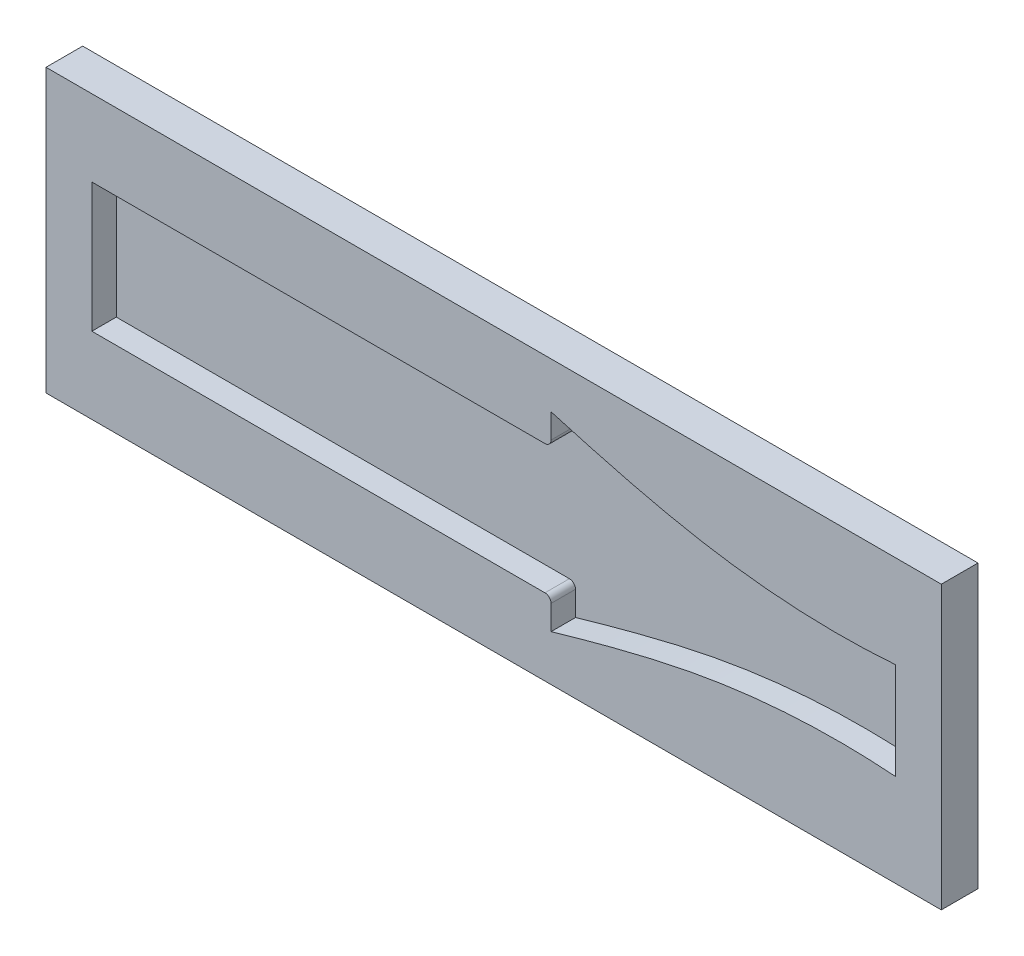
ISO-10303-21;
HEADER;
FILE_DESCRIPTION(('STEP AP214'),'2;1');
FILE_NAME('part.step','',(''),(''),'','','');
FILE_SCHEMA(('AUTOMOTIVE_DESIGN { 1 0 10303 214 1 1 1 1 }'));
ENDSEC;
DATA;
#1=APPLICATION_CONTEXT('core data for automotive mechanical design processes');
#2=APPLICATION_PROTOCOL_DEFINITION('international standard','automotive_design',2000,#1);
#3=PRODUCT_CONTEXT('',#1,'mechanical');
#4=PRODUCT('Part','Part','',(#3));
#5=PRODUCT_RELATED_PRODUCT_CATEGORY('part','',(#4));
#6=PRODUCT_DEFINITION_FORMATION('','',#4);
#7=PRODUCT_DEFINITION_CONTEXT('part definition',#1,'design');
#8=PRODUCT_DEFINITION('design','',#6,#7);
#9=PRODUCT_DEFINITION_SHAPE('','',#8);
#10=(LENGTH_UNIT() NAMED_UNIT(*) SI_UNIT(.MILLI.,.METRE.));
#11=(NAMED_UNIT(*) PLANE_ANGLE_UNIT() SI_UNIT($,.RADIAN.));
#12=(NAMED_UNIT(*) SI_UNIT($,.STERADIAN.) SOLID_ANGLE_UNIT());
#13=UNCERTAINTY_MEASURE_WITH_UNIT(LENGTH_MEASURE(1.E-05),#10,'distance_accuracy_value','');
#14=(GEOMETRIC_REPRESENTATION_CONTEXT(3) GLOBAL_UNCERTAINTY_ASSIGNED_CONTEXT((#13)) GLOBAL_UNIT_ASSIGNED_CONTEXT((#10,
#11,#12)) REPRESENTATION_CONTEXT('',''));
#15=CARTESIAN_POINT('',(0.,0.,0.));
#16=DIRECTION('',(0.,0.,1.));
#17=DIRECTION('',(1.,0.,0.));
#18=AXIS2_PLACEMENT_3D('',#15,#16,#17);
#19=CARTESIAN_POINT('',(155.9,15.5713450063718,10.));
#20=DIRECTION('',(1.,0.,0.));
#21=DIRECTION('',(0.,0.,-1.));
#22=AXIS2_PLACEMENT_3D('',#19,#20,#21);
#23=PLANE('',#22);
#24=DIRECTION('',(0.,-1.,0.));
#25=VECTOR('',#24,1.);
#26=CARTESIAN_POINT('',(155.9,15.5713450063718,10.));
#27=LINE('',#26,#25);
#28=CARTESIAN_POINT('',(155.9,10.5713450063718,10.));
#29=VERTEX_POINT('',#28);
#30=CARTESIAN_POINT('',(155.9,-10.5713450063718,10.));
#31=VERTEX_POINT('',#30);
#32=EDGE_CURVE('E301',#29,#31,#27,.T.);
#33=ORIENTED_EDGE('',*,*,#32,.T.);
#34=DIRECTION('',(0.,0.,-1.));
#35=VECTOR('',#34,1.);
#36=CARTESIAN_POINT('',(155.9,-10.5713450063718,10.));
#37=LINE('',#36,#35);
#38=CARTESIAN_POINT('',(155.9,-10.5713450063718,6.));
#39=VERTEX_POINT('',#38);
#40=EDGE_CURVE('E243',#31,#39,#37,.T.);
#41=ORIENTED_EDGE('',*,*,#40,.T.);
#42=DIRECTION('',(0.,-1.,0.));
#43=VECTOR('',#42,1.);
#44=CARTESIAN_POINT('',(155.9,15.5713450063718,6.));
#45=LINE('',#44,#43);
#46=CARTESIAN_POINT('',(155.9,10.5713450063718,6.));
#47=VERTEX_POINT('',#46);
#48=EDGE_CURVE('E281',#47,#39,#45,.T.);
#49=ORIENTED_EDGE('',*,*,#48,.F.);
#50=DIRECTION('',(0.,0.,-1.));
#51=VECTOR('',#50,1.);
#52=CARTESIAN_POINT('',(155.9,10.5713450063718,10.));
#53=LINE('',#52,#51);
#54=EDGE_CURVE('E272',#29,#47,#53,.T.);
#55=ORIENTED_EDGE('',*,*,#54,.F.);
#56=EDGE_LOOP('',(#33,#41,#49,#55));
#57=FACE_BOUND('',#56,.T.);
#58=ADVANCED_FACE('F40',(#57),#23,.T.);
#59=CARTESIAN_POINT('',(0.,0.,6.));
#60=DIRECTION('',(0.,0.,1.));
#61=DIRECTION('',(1.,0.,0.));
#62=AXIS2_PLACEMENT_3D('',#59,#60,#61);
#63=PLANE('',#62);
#64=CARTESIAN_POINT('',(230.014073024287,-11.5713450063718,6.));
#65=DIRECTION('',(0.,0.,1.));
#66=DIRECTION('',(1.,0.,0.));
#67=AXIS2_PLACEMENT_3D('',#64,#65,#66);
#68=CIRCLE('',#67,1.);
#69=CARTESIAN_POINT('',(231.014073024287,-11.5713450063718,6.));
#70=VERTEX_POINT('',#69);
#71=CARTESIAN_POINT('',(230.014073024287,-10.5713450063718,6.));
#72=VERTEX_POINT('',#71);
#73=EDGE_CURVE('E233',#70,#72,#68,.T.);
#74=ORIENTED_EDGE('',*,*,#73,.F.);
#75=DIRECTION('',(0.,1.,0.));
#76=VECTOR('',#75,1.);
#77=CARTESIAN_POINT('',(231.014073024287,-15.5713450063718,6.));
#78=LINE('',#77,#76);
#79=CARTESIAN_POINT('',(231.014073024287,-15.5713450063718,6.));
#80=VERTEX_POINT('',#79);
#81=EDGE_CURVE('E239',#80,#70,#78,.T.);
#82=ORIENTED_EDGE('',*,*,#81,.F.);
#83=CARTESIAN_POINT('',(231.014073024287,-15.5713450063718,6.));
#84=CARTESIAN_POINT('',(235.603926113543,-14.2533804538712,6.));
#85=CARTESIAN_POINT('',(240.202907460829,-12.9692204062925,6.));
#86=CARTESIAN_POINT('',(247.161881800871,-11.2670374263677,6.));
#87=CARTESIAN_POINT('',(249.48937433245,-10.7379913566048,6.));
#88=CARTESIAN_POINT('',(254.16564176773,-9.78721352573088,6.));
#89=CARTESIAN_POINT('',(256.514768347563,-9.36682252587505,6.));
#90=CARTESIAN_POINT('',(263.601279745271,-8.30142744081336,6.));
#91=CARTESIAN_POINT('',(268.33808653074,-7.84882620076479,6.));
#92=CARTESIAN_POINT('',(275.456073059196,-7.56828948111183,6.));
#93=CARTESIAN_POINT('',(277.831222275919,-7.54136255551402,6.));
#94=CARTESIAN_POINT('',(282.586677641529,-7.62557478684483,6.));
#95=CARTESIAN_POINT('',(284.967063297442,-7.73884257829425,6.));
#96=CARTESIAN_POINT('',(287.35,-7.9204093128877,6.));
#97=B_SPLINE_CURVE_WITH_KNOTS('',3,(#83,#84,#85,#86,#87,#88,#89,#90,#91,#92,#93,#94,#95,#96),
.UNSPECIFIED.,.F.,.F.,(4,2,2,2,2,2,4),(0.,0.25,0.375000000000001,0.500000000000002,
0.750000000000001,0.875000000000001,1.),.UNSPECIFIED.);
#98=CARTESIAN_POINT('',(287.35,-7.9204093128877,6.));
#99=VERTEX_POINT('',#98);
#100=EDGE_CURVE('E275',#80,#99,#97,.T.);
#101=ORIENTED_EDGE('',*,*,#100,.T.);
#102=DIRECTION('',(0.,1.,0.));
#103=VECTOR('',#102,1.);
#104=CARTESIAN_POINT('',(287.35,-7.9204093128877,6.));
#105=LINE('',#104,#103);
#106=CARTESIAN_POINT('',(287.35,7.92040931288748,6.));
#107=VERTEX_POINT('',#106);
#108=EDGE_CURVE('E49',#99,#107,#105,.T.);
#109=ORIENTED_EDGE('',*,*,#108,.T.);
#110=CARTESIAN_POINT('',(287.35,7.92040931288747,6.));
#111=CARTESIAN_POINT('',(284.969156465428,7.73900206624337,6.));
#112=CARTESIAN_POINT('',(282.587135428671,7.62548449338519,6.));
#113=CARTESIAN_POINT('',(277.8206161659,7.54127334658861,6.));
#114=CARTESIAN_POINT('',(275.436154733433,7.56845841607429,6.));
#115=CARTESIAN_POINT('',(268.279260354869,7.85238969523881,6.));
#116=CARTESIAN_POINT('',(263.532649453203,8.30935777848794,6.));
#117=CARTESIAN_POINT('',(256.450993940036,9.37762924089552,6.));
#118=CARTESIAN_POINT('',(254.104302815862,9.79880165950476,6.));
#119=CARTESIAN_POINT('',(249.438001236652,10.7493414193286,6.));
#120=CARTESIAN_POINT('',(247.117364999516,11.2775083415618,6.));
#121=CARTESIAN_POINT('',(240.182218105515,12.9751270956092,6.));
#122=CARTESIAN_POINT('',(235.594114601691,14.2561978043551,6.));
#123=CARTESIAN_POINT('',(231.014073024287,15.5713450063718,6.));
#124=B_SPLINE_CURVE_WITH_KNOTS('',3,(#110,#111,#112,#113,#114,#115,#116,#117,#118,#119,#120,
#121,#122,#123),.UNSPECIFIED.,.F.,.F.,(4,2,2,2,2,2,4),(0.,0.124999999999999,0.249999999999998,
0.499999999999995,0.624999999999995,0.749999999999997,1.),.UNSPECIFIED.);
#125=CARTESIAN_POINT('',(231.014073024287,15.5713450063718,6.));
#126=VERTEX_POINT('',#125);
#127=EDGE_CURVE('E288',#107,#126,#124,.T.);
#128=ORIENTED_EDGE('',*,*,#127,.T.);
#129=DIRECTION('',(0.,1.,0.));
#130=VECTOR('',#129,1.);
#131=CARTESIAN_POINT('',(231.014073024287,15.5713450063718,6.));
#132=LINE('',#131,#130);
#133=CARTESIAN_POINT('',(231.014073024287,11.5713450063718,6.));
#134=VERTEX_POINT('',#133);
#135=EDGE_CURVE('E251',#134,#126,#132,.T.);
#136=ORIENTED_EDGE('',*,*,#135,.F.);
#137=CARTESIAN_POINT('',(230.014073024287,11.5713450063718,6.));
#138=DIRECTION('',(0.,0.,1.));
#139=DIRECTION('',(-1.,0.,0.));
#140=AXIS2_PLACEMENT_3D('',#137,#138,#139);
#141=CIRCLE('',#140,1.);
#142=CARTESIAN_POINT('',(230.014073024287,10.5713450063718,6.));
#143=VERTEX_POINT('',#142);
#144=EDGE_CURVE('E220',#143,#134,#141,.T.);
#145=ORIENTED_EDGE('',*,*,#144,.F.);
#146=DIRECTION('',(1.,0.,0.));
#147=VECTOR('',#146,1.);
#148=CARTESIAN_POINT('',(230.014073024287,10.5713450063718,6.));
#149=LINE('',#148,#147);
#150=EDGE_CURVE('E260',#47,#143,#149,.T.);
#151=ORIENTED_EDGE('',*,*,#150,.F.);
#152=ORIENTED_EDGE('',*,*,#48,.T.);
#153=DIRECTION('',(-1.,0.,0.));
#154=VECTOR('',#153,1.);
#155=CARTESIAN_POINT('',(230.014073024287,-10.5713450063718,6.));
#156=LINE('',#155,#154);
#157=EDGE_CURVE('E226',#72,#39,#156,.T.);
#158=ORIENTED_EDGE('',*,*,#157,.F.);
#159=EDGE_LOOP('',(#74,#82,#101,#109,#128,#136,#145,#151,#152,#158));
#160=FACE_BOUND('',#159,.T.);
#161=ADVANCED_FACE('F197',(#160),#63,.T.);
#162=CARTESIAN_POINT('',(0.,0.,10.));
#163=DIRECTION('',(0.,0.,1.));
#164=DIRECTION('',(1.,0.,0.));
#165=AXIS2_PLACEMENT_3D('',#162,#163,#164);
#166=PLANE('',#165);
#167=DIRECTION('',(0.,-1.,0.));
#168=VECTOR('',#167,1.);
#169=CARTESIAN_POINT('',(148.4,23.0713450063718,10.));
#170=LINE('',#169,#168);
#171=CARTESIAN_POINT('',(148.4,23.0713450063718,10.));
#172=VERTEX_POINT('',#171);
#173=CARTESIAN_POINT('',(148.4,-23.0713450063718,10.));
#174=VERTEX_POINT('',#173);
#175=EDGE_CURVE('E369',#172,#174,#170,.T.);
#176=ORIENTED_EDGE('',*,*,#175,.T.);
#177=DIRECTION('',(1.,0.,0.));
#178=VECTOR('',#177,1.);
#179=CARTESIAN_POINT('',(148.4,-23.0713450063718,10.));
#180=LINE('',#179,#178);
#181=CARTESIAN_POINT('',(294.85,-23.0713450063718,10.));
#182=VERTEX_POINT('',#181);
#183=EDGE_CURVE('E375',#174,#182,#180,.T.);
#184=ORIENTED_EDGE('',*,*,#183,.T.);
#185=DIRECTION('',(0.,1.,0.));
#186=VECTOR('',#185,1.);
#187=CARTESIAN_POINT('',(294.85,23.0713450063718,10.));
#188=LINE('',#187,#186);
#189=CARTESIAN_POINT('',(294.85,23.0713450063718,10.));
#190=VERTEX_POINT('',#189);
#191=EDGE_CURVE('E378',#182,#190,#188,.T.);
#192=ORIENTED_EDGE('',*,*,#191,.T.);
#193=DIRECTION('',(-1.,0.,0.));
#194=VECTOR('',#193,1.);
#195=CARTESIAN_POINT('',(148.4,23.0713450063718,10.));
#196=LINE('',#195,#194);
#197=EDGE_CURVE('E160',#190,#172,#196,.T.);
#198=ORIENTED_EDGE('',*,*,#197,.T.);
#199=EDGE_LOOP('',(#176,#184,#192,#198));
#200=FACE_BOUND('',#199,.T.);
#201=DIRECTION('',(0.,1.,0.));
#202=VECTOR('',#201,1.);
#203=CARTESIAN_POINT('',(231.014073024287,15.5713450063718,10.));
#204=LINE('',#203,#202);
#205=CARTESIAN_POINT('',(231.014073024287,11.5713450063718,10.));
#206=VERTEX_POINT('',#205);
#207=CARTESIAN_POINT('',(231.014073024287,15.5713450063718,10.));
#208=VERTEX_POINT('',#207);
#209=EDGE_CURVE('E216',#206,#208,#204,.T.);
#210=ORIENTED_EDGE('',*,*,#209,.T.);
#211=CARTESIAN_POINT('',(287.35,7.92040931288747,10.));
#212=CARTESIAN_POINT('',(284.969156465428,7.73900206624337,10.));
#213=CARTESIAN_POINT('',(282.587135428671,7.62548449338519,10.));
#214=CARTESIAN_POINT('',(277.8206161659,7.54127334658861,10.));
#215=CARTESIAN_POINT('',(275.436154733433,7.56845841607429,10.));
#216=CARTESIAN_POINT('',(268.279260354869,7.85238969523881,10.));
#217=CARTESIAN_POINT('',(263.532649453203,8.30935777848794,10.));
#218=CARTESIAN_POINT('',(256.450993940036,9.37762924089552,10.));
#219=CARTESIAN_POINT('',(254.104302815862,9.79880165950476,10.));
#220=CARTESIAN_POINT('',(249.438001236652,10.7493414193286,10.));
#221=CARTESIAN_POINT('',(247.117364999516,11.2775083415618,10.));
#222=CARTESIAN_POINT('',(240.182218105515,12.9751270956092,10.));
#223=CARTESIAN_POINT('',(235.594114601691,14.2561978043551,10.));
#224=CARTESIAN_POINT('',(231.014073024287,15.5713450063718,10.));
#225=B_SPLINE_CURVE_WITH_KNOTS('',3,(#211,#212,#213,#214,#215,#216,#217,#218,#219,#220,#221,
#222,#223,#224),.UNSPECIFIED.,.F.,.F.,(4,2,2,2,2,2,4),(0.,0.124999999999999,0.249999999999998,
0.499999999999995,0.624999999999995,0.749999999999997,1.),.UNSPECIFIED.);
#226=CARTESIAN_POINT('',(287.35,7.92040931288747,10.));
#227=VERTEX_POINT('',#226);
#228=EDGE_CURVE('E293',#227,#208,#225,.T.);
#229=ORIENTED_EDGE('',*,*,#228,.F.);
#230=DIRECTION('',(0.,1.,0.));
#231=VECTOR('',#230,1.);
#232=CARTESIAN_POINT('',(287.35,-7.9204093128877,10.));
#233=LINE('',#232,#231);
#234=CARTESIAN_POINT('',(287.35,-7.9204093128877,10.));
#235=VERTEX_POINT('',#234);
#236=EDGE_CURVE('E345',#235,#227,#233,.T.);
#237=ORIENTED_EDGE('',*,*,#236,.F.);
#238=CARTESIAN_POINT('',(231.014073024287,-15.5713450063718,10.));
#239=CARTESIAN_POINT('',(235.603926113543,-14.2533804538712,10.));
#240=CARTESIAN_POINT('',(240.202907460829,-12.9692204062925,10.));
#241=CARTESIAN_POINT('',(247.161881800871,-11.2670374263677,10.));
#242=CARTESIAN_POINT('',(249.48937433245,-10.7379913566048,10.));
#243=CARTESIAN_POINT('',(254.16564176773,-9.78721352573088,10.));
#244=CARTESIAN_POINT('',(256.514768347563,-9.36682252587505,10.));
#245=CARTESIAN_POINT('',(263.601279745271,-8.30142744081336,10.));
#246=CARTESIAN_POINT('',(268.33808653074,-7.84882620076479,10.));
#247=CARTESIAN_POINT('',(275.456073059196,-7.56828948111183,10.));
#248=CARTESIAN_POINT('',(277.831222275919,-7.54136255551402,10.));
#249=CARTESIAN_POINT('',(282.586677641529,-7.62557478684483,10.));
#250=CARTESIAN_POINT('',(284.967063297442,-7.73884257829425,10.));
#251=CARTESIAN_POINT('',(287.35,-7.9204093128877,10.));
#252=B_SPLINE_CURVE_WITH_KNOTS('',3,(#238,#239,#240,#241,#242,#243,#244,#245,#246,#247,#248,
#249,#250,#251),.UNSPECIFIED.,.F.,.F.,(4,2,2,2,2,2,4),(0.,0.25,0.375000000000001,
0.500000000000002,0.750000000000001,0.875000000000001,1.),.UNSPECIFIED.);
#253=CARTESIAN_POINT('',(231.014073024287,-15.5713450063718,10.));
#254=VERTEX_POINT('',#253);
#255=EDGE_CURVE('E180',#254,#235,#252,.T.);
#256=ORIENTED_EDGE('',*,*,#255,.F.);
#257=DIRECTION('',(0.,1.,0.));
#258=VECTOR('',#257,1.);
#259=CARTESIAN_POINT('',(231.014073024287,-15.5713450063718,10.));
#260=LINE('',#259,#258);
#261=CARTESIAN_POINT('',(231.014073024287,-11.5713450063718,10.));
#262=VERTEX_POINT('',#261);
#263=EDGE_CURVE('E223',#254,#262,#260,.T.);
#264=ORIENTED_EDGE('',*,*,#263,.T.);
#265=CARTESIAN_POINT('',(230.014073024287,-11.5713450063718,10.));
#266=DIRECTION('',(0.,0.,1.));
#267=DIRECTION('',(1.,0.,0.));
#268=AXIS2_PLACEMENT_3D('',#265,#266,#267);
#269=CIRCLE('',#268,1.);
#270=CARTESIAN_POINT('',(230.014073024287,-10.5713450063718,10.));
#271=VERTEX_POINT('',#270);
#272=EDGE_CURVE('E225',#262,#271,#269,.T.);
#273=ORIENTED_EDGE('',*,*,#272,.T.);
#274=DIRECTION('',(-1.,0.,0.));
#275=VECTOR('',#274,1.);
#276=CARTESIAN_POINT('',(230.014073024287,-10.5713450063718,10.));
#277=LINE('',#276,#275);
#278=EDGE_CURVE('E231',#271,#31,#277,.T.);
#279=ORIENTED_EDGE('',*,*,#278,.T.);
#280=ORIENTED_EDGE('',*,*,#32,.F.);
#281=DIRECTION('',(1.,0.,0.));
#282=VECTOR('',#281,1.);
#283=CARTESIAN_POINT('',(230.014073024287,10.5713450063718,10.));
#284=LINE('',#283,#282);
#285=CARTESIAN_POINT('',(230.014073024287,10.5713450063718,10.));
#286=VERTEX_POINT('',#285);
#287=EDGE_CURVE('E219',#29,#286,#284,.T.);
#288=ORIENTED_EDGE('',*,*,#287,.T.);
#289=CARTESIAN_POINT('',(230.014073024287,11.5713450063718,10.));
#290=DIRECTION('',(0.,0.,1.));
#291=DIRECTION('',(-1.,0.,0.));
#292=AXIS2_PLACEMENT_3D('',#289,#290,#291);
#293=CIRCLE('',#292,1.);
#294=EDGE_CURVE('E254',#286,#206,#293,.T.);
#295=ORIENTED_EDGE('',*,*,#294,.T.);
#296=EDGE_LOOP('',(#210,#229,#237,#256,#264,#273,#279,#280,#288,#295));
#297=FACE_BOUND('',#296,.T.);
#298=ADVANCED_FACE('F187',(#200,#297),#166,.T.);
#299=CARTESIAN_POINT('',(148.4,23.0713450063718,10.));
#300=DIRECTION('',(1.,0.,0.));
#301=DIRECTION('',(0.,0.,-1.));
#302=AXIS2_PLACEMENT_3D('',#299,#300,#301);
#303=PLANE('',#302);
#304=DIRECTION('',(0.,0.,-1.));
#305=VECTOR('',#304,1.);
#306=CARTESIAN_POINT('',(148.4,23.0713450063718,10.));
#307=LINE('',#306,#305);
#308=CARTESIAN_POINT('',(148.4,23.0713450063718,4.));
#309=VERTEX_POINT('',#308);
#310=EDGE_CURVE('E162',#172,#309,#307,.T.);
#311=ORIENTED_EDGE('',*,*,#310,.T.);
#312=DIRECTION('',(0.,-1.,0.));
#313=VECTOR('',#312,1.);
#314=CARTESIAN_POINT('',(148.4,23.0713450063718,4.));
#315=LINE('',#314,#313);
#316=CARTESIAN_POINT('',(148.4,-23.0713450063718,4.));
#317=VERTEX_POINT('',#316);
#318=EDGE_CURVE('E56',#309,#317,#315,.T.);
#319=ORIENTED_EDGE('',*,*,#318,.T.);
#320=DIRECTION('',(0.,0.,-1.));
#321=VECTOR('',#320,1.);
#322=CARTESIAN_POINT('',(148.4,-23.0713450063718,10.));
#323=LINE('',#322,#321);
#324=EDGE_CURVE('E166',#174,#317,#323,.T.);
#325=ORIENTED_EDGE('',*,*,#324,.F.);
#326=ORIENTED_EDGE('',*,*,#175,.F.);
#327=EDGE_LOOP('',(#311,#319,#325,#326));
#328=FACE_BOUND('',#327,.T.);
#329=ADVANCED_FACE('F42',(#328),#303,.F.);
#330=CARTESIAN_POINT('',(148.4,-23.0713450063718,10.));
#331=DIRECTION('',(0.,1.,0.));
#332=DIRECTION('',(0.,0.,1.));
#333=AXIS2_PLACEMENT_3D('',#330,#331,#332);
#334=PLANE('',#333);
#335=ORIENTED_EDGE('',*,*,#324,.T.);
#336=DIRECTION('',(1.,0.,0.));
#337=VECTOR('',#336,1.);
#338=CARTESIAN_POINT('',(148.4,-23.0713450063718,4.));
#339=LINE('',#338,#337);
#340=CARTESIAN_POINT('',(294.85,-23.0713450063718,4.));
#341=VERTEX_POINT('',#340);
#342=EDGE_CURVE('E157',#317,#341,#339,.T.);
#343=ORIENTED_EDGE('',*,*,#342,.T.);
#344=DIRECTION('',(0.,0.,-1.));
#345=VECTOR('',#344,1.);
#346=CARTESIAN_POINT('',(294.85,-23.0713450063718,10.));
#347=LINE('',#346,#345);
#348=EDGE_CURVE('E155',#182,#341,#347,.T.);
#349=ORIENTED_EDGE('',*,*,#348,.F.);
#350=ORIENTED_EDGE('',*,*,#183,.F.);
#351=EDGE_LOOP('',(#335,#343,#349,#350));
#352=FACE_BOUND('',#351,.T.);
#353=ADVANCED_FACE('F385',(#352),#334,.F.);
#354=CARTESIAN_POINT('',(294.85,23.0713450063718,10.));
#355=DIRECTION('',(-1.,0.,0.));
#356=DIRECTION('',(0.,0.,1.));
#357=AXIS2_PLACEMENT_3D('',#354,#355,#356);
#358=PLANE('',#357);
#359=ORIENTED_EDGE('',*,*,#348,.T.);
#360=DIRECTION('',(0.,1.,0.));
#361=VECTOR('',#360,1.);
#362=CARTESIAN_POINT('',(294.85,23.0713450063718,4.));
#363=LINE('',#362,#361);
#364=CARTESIAN_POINT('',(294.85,23.0713450063718,4.));
#365=VERTEX_POINT('',#364);
#366=EDGE_CURVE('E141',#341,#365,#363,.T.);
#367=ORIENTED_EDGE('',*,*,#366,.T.);
#368=DIRECTION('',(0.,0.,-1.));
#369=VECTOR('',#368,1.);
#370=CARTESIAN_POINT('',(294.85,23.0713450063718,10.));
#371=LINE('',#370,#369);
#372=EDGE_CURVE('E152',#190,#365,#371,.T.);
#373=ORIENTED_EDGE('',*,*,#372,.F.);
#374=ORIENTED_EDGE('',*,*,#191,.F.);
#375=EDGE_LOOP('',(#359,#367,#373,#374));
#376=FACE_BOUND('',#375,.T.);
#377=ADVANCED_FACE('F150',(#376),#358,.F.);
#378=CARTESIAN_POINT('',(148.4,23.0713450063718,10.));
#379=DIRECTION('',(0.,-1.,0.));
#380=DIRECTION('',(0.,0.,-1.));
#381=AXIS2_PLACEMENT_3D('',#378,#379,#380);
#382=PLANE('',#381);
#383=ORIENTED_EDGE('',*,*,#372,.T.);
#384=DIRECTION('',(-1.,0.,0.));
#385=VECTOR('',#384,1.);
#386=CARTESIAN_POINT('',(148.4,23.0713450063718,4.));
#387=LINE('',#386,#385);
#388=EDGE_CURVE('E12',#365,#309,#387,.T.);
#389=ORIENTED_EDGE('',*,*,#388,.T.);
#390=ORIENTED_EDGE('',*,*,#310,.F.);
#391=ORIENTED_EDGE('',*,*,#197,.F.);
#392=EDGE_LOOP('',(#383,#389,#390,#391));
#393=FACE_BOUND('',#392,.T.);
#394=ADVANCED_FACE('F159',(#393),#382,.F.);
#395=CARTESIAN_POINT('',(287.35,7.92040931288747,10.));
#396=CARTESIAN_POINT('',(284.969156465428,7.73900206624337,10.));
#397=CARTESIAN_POINT('',(282.587135428671,7.62548449338519,10.));
#398=CARTESIAN_POINT('',(277.8206161659,7.54127334658861,10.));
#399=CARTESIAN_POINT('',(275.436154733433,7.56845841607429,10.));
#400=CARTESIAN_POINT('',(268.279260354869,7.85238969523881,10.));
#401=CARTESIAN_POINT('',(263.532649453203,8.30935777848794,10.));
#402=CARTESIAN_POINT('',(256.450993940036,9.37762924089552,10.));
#403=CARTESIAN_POINT('',(254.104302815862,9.79880165950476,10.));
#404=CARTESIAN_POINT('',(249.438001236652,10.7493414193286,10.));
#405=CARTESIAN_POINT('',(247.117364999516,11.2775083415618,10.));
#406=CARTESIAN_POINT('',(240.182218105515,12.9751270956092,10.));
#407=CARTESIAN_POINT('',(235.594114601691,14.2561978043551,10.));
#408=CARTESIAN_POINT('',(231.014073024287,15.5713450063718,10.));
#409=B_SPLINE_CURVE_WITH_KNOTS('',3,(#395,#396,#397,#398,#399,#400,#401,#402,#403,#404,#405,
#406,#407,#408),.UNSPECIFIED.,.F.,.F.,(4,2,2,2,2,2,4),(0.,0.124999999999999,0.249999999999998,
0.499999999999995,0.624999999999995,0.749999999999997,1.),.UNSPECIFIED.);
#410=DIRECTION('',(0.,0.,-1.));
#411=VECTOR('',#410,1.);
#412=SURFACE_OF_LINEAR_EXTRUSION('',#409,#411);
#413=ORIENTED_EDGE('',*,*,#127,.F.);
#414=DIRECTION('',(0.,0.,-1.));
#415=VECTOR('',#414,1.);
#416=CARTESIAN_POINT('',(287.35,7.92040931288747,10.));
#417=LINE('',#416,#415);
#418=EDGE_CURVE('E342',#227,#107,#417,.T.);
#419=ORIENTED_EDGE('',*,*,#418,.F.);
#420=ORIENTED_EDGE('',*,*,#228,.T.);
#421=DIRECTION('',(0.,0.,-1.));
#422=VECTOR('',#421,1.);
#423=CARTESIAN_POINT('',(231.014073024287,15.5713450063718,10.));
#424=LINE('',#423,#422);
#425=EDGE_CURVE('E335',#208,#126,#424,.T.);
#426=ORIENTED_EDGE('',*,*,#425,.T.);
#427=EDGE_LOOP('',(#413,#419,#420,#426));
#428=FACE_BOUND('',#427,.T.);
#429=ADVANCED_FACE('F199',(#428),#412,.T.);
#430=CARTESIAN_POINT('',(231.014073024287,-15.5713450063718,10.));
#431=CARTESIAN_POINT('',(235.603926113543,-14.2533804538712,10.));
#432=CARTESIAN_POINT('',(240.202907460829,-12.9692204062925,10.));
#433=CARTESIAN_POINT('',(247.161881800871,-11.2670374263677,10.));
#434=CARTESIAN_POINT('',(249.48937433245,-10.7379913566048,10.));
#435=CARTESIAN_POINT('',(254.16564176773,-9.78721352573088,10.));
#436=CARTESIAN_POINT('',(256.514768347563,-9.36682252587505,10.));
#437=CARTESIAN_POINT('',(263.601279745271,-8.30142744081336,10.));
#438=CARTESIAN_POINT('',(268.33808653074,-7.84882620076479,10.));
#439=CARTESIAN_POINT('',(275.456073059196,-7.56828948111183,10.));
#440=CARTESIAN_POINT('',(277.831222275919,-7.54136255551402,10.));
#441=CARTESIAN_POINT('',(282.586677641529,-7.62557478684483,10.));
#442=CARTESIAN_POINT('',(284.967063297442,-7.73884257829425,10.));
#443=CARTESIAN_POINT('',(287.35,-7.9204093128877,10.));
#444=B_SPLINE_CURVE_WITH_KNOTS('',3,(#430,#431,#432,#433,#434,#435,#436,#437,#438,#439,#440,
#441,#442,#443),.UNSPECIFIED.,.F.,.F.,(4,2,2,2,2,2,4),(0.,0.25,0.375000000000001,
0.500000000000002,0.750000000000001,0.875000000000001,1.),.UNSPECIFIED.);
#445=DIRECTION('',(0.,0.,-1.));
#446=VECTOR('',#445,1.);
#447=SURFACE_OF_LINEAR_EXTRUSION('',#444,#446);
#448=ORIENTED_EDGE('',*,*,#100,.F.);
#449=DIRECTION('',(0.,0.,-1.));
#450=VECTOR('',#449,1.);
#451=CARTESIAN_POINT('',(231.014073024287,-15.5713450063718,10.));
#452=LINE('',#451,#450);
#453=EDGE_CURVE('E327',#254,#80,#452,.T.);
#454=ORIENTED_EDGE('',*,*,#453,.F.);
#455=ORIENTED_EDGE('',*,*,#255,.T.);
#456=DIRECTION('',(0.,0.,-1.));
#457=VECTOR('',#456,1.);
#458=CARTESIAN_POINT('',(287.35,-7.9204093128877,10.));
#459=LINE('',#458,#457);
#460=EDGE_CURVE('E336',#235,#99,#459,.T.);
#461=ORIENTED_EDGE('',*,*,#460,.T.);
#462=EDGE_LOOP('',(#448,#454,#455,#461));
#463=FACE_BOUND('',#462,.T.);
#464=ADVANCED_FACE('F317',(#463),#447,.T.);
#465=CARTESIAN_POINT('',(287.35,-7.9204093128877,10.));
#466=DIRECTION('',(-1.,0.,0.));
#467=DIRECTION('',(0.,0.,1.));
#468=AXIS2_PLACEMENT_3D('',#465,#466,#467);
#469=PLANE('',#468);
#470=ORIENTED_EDGE('',*,*,#108,.F.);
#471=ORIENTED_EDGE('',*,*,#460,.F.);
#472=ORIENTED_EDGE('',*,*,#236,.T.);
#473=ORIENTED_EDGE('',*,*,#418,.T.);
#474=EDGE_LOOP('',(#470,#471,#472,#473));
#475=FACE_BOUND('',#474,.T.);
#476=ADVANCED_FACE('F321',(#475),#469,.T.);
#477=CARTESIAN_POINT('',(231.014073024287,15.5713450063718,10.));
#478=DIRECTION('',(-1.,0.,0.));
#479=DIRECTION('',(0.,0.,1.));
#480=AXIS2_PLACEMENT_3D('',#477,#478,#479);
#481=PLANE('',#480);
#482=ORIENTED_EDGE('',*,*,#135,.T.);
#483=ORIENTED_EDGE('',*,*,#425,.F.);
#484=ORIENTED_EDGE('',*,*,#209,.F.);
#485=DIRECTION('',(0.,0.,-1.));
#486=VECTOR('',#485,1.);
#487=CARTESIAN_POINT('',(231.014073024287,11.5713450063718,10.));
#488=LINE('',#487,#486);
#489=EDGE_CURVE('E257',#206,#134,#488,.T.);
#490=ORIENTED_EDGE('',*,*,#489,.T.);
#491=EDGE_LOOP('',(#482,#483,#484,#490));
#492=FACE_BOUND('',#491,.T.);
#493=ADVANCED_FACE('F420',(#492),#481,.F.);
#494=CARTESIAN_POINT('',(230.014073024287,10.5713450063718,10.));
#495=DIRECTION('',(0.,1.,0.));
#496=DIRECTION('',(-1.,0.,0.));
#497=AXIS2_PLACEMENT_3D('',#494,#495,#496);
#498=PLANE('',#497);
#499=ORIENTED_EDGE('',*,*,#150,.T.);
#500=DIRECTION('',(0.,0.,-1.));
#501=VECTOR('',#500,1.);
#502=CARTESIAN_POINT('',(230.014073024287,10.5713450063718,10.));
#503=LINE('',#502,#501);
#504=EDGE_CURVE('E269',#286,#143,#503,.T.);
#505=ORIENTED_EDGE('',*,*,#504,.F.);
#506=ORIENTED_EDGE('',*,*,#287,.F.);
#507=ORIENTED_EDGE('',*,*,#54,.T.);
#508=EDGE_LOOP('',(#499,#505,#506,#507));
#509=FACE_BOUND('',#508,.T.);
#510=ADVANCED_FACE('F410',(#509),#498,.F.);
#511=CARTESIAN_POINT('',(230.014073024287,11.5713450063718,10.));
#512=DIRECTION('',(0.,0.,-1.));
#513=DIRECTION('',(-1.,0.,0.));
#514=AXIS2_PLACEMENT_3D('',#511,#512,#513);
#515=CYLINDRICAL_SURFACE('',#514,1.);
#516=ORIENTED_EDGE('',*,*,#144,.T.);
#517=ORIENTED_EDGE('',*,*,#489,.F.);
#518=ORIENTED_EDGE('',*,*,#294,.F.);
#519=ORIENTED_EDGE('',*,*,#504,.T.);
#520=EDGE_LOOP('',(#516,#517,#518,#519));
#521=FACE_BOUND('',#520,.T.);
#522=ADVANCED_FACE('F416',(#521),#515,.T.);
#523=CARTESIAN_POINT('',(231.014073024287,-15.5713450063718,10.));
#524=DIRECTION('',(-1.,0.,0.));
#525=DIRECTION('',(0.,0.,1.));
#526=AXIS2_PLACEMENT_3D('',#523,#524,#525);
#527=PLANE('',#526);
#528=ORIENTED_EDGE('',*,*,#81,.T.);
#529=DIRECTION('',(0.,0.,-1.));
#530=VECTOR('',#529,1.);
#531=CARTESIAN_POINT('',(231.014073024287,-11.5713450063718,10.));
#532=LINE('',#531,#530);
#533=EDGE_CURVE('E248',#262,#70,#532,.T.);
#534=ORIENTED_EDGE('',*,*,#533,.F.);
#535=ORIENTED_EDGE('',*,*,#263,.F.);
#536=ORIENTED_EDGE('',*,*,#453,.T.);
#537=EDGE_LOOP('',(#528,#534,#535,#536));
#538=FACE_BOUND('',#537,.T.);
#539=ADVANCED_FACE('F397',(#538),#527,.F.);
#540=CARTESIAN_POINT('',(230.014073024287,-11.5713450063718,10.));
#541=DIRECTION('',(0.,0.,-1.));
#542=DIRECTION('',(-1.,0.,0.));
#543=AXIS2_PLACEMENT_3D('',#540,#541,#542);
#544=CYLINDRICAL_SURFACE('',#543,1.);
#545=ORIENTED_EDGE('',*,*,#73,.T.);
#546=DIRECTION('',(0.,0.,-1.));
#547=VECTOR('',#546,1.);
#548=CARTESIAN_POINT('',(230.014073024287,-10.5713450063718,10.));
#549=LINE('',#548,#547);
#550=EDGE_CURVE('E63',#271,#72,#549,.T.);
#551=ORIENTED_EDGE('',*,*,#550,.F.);
#552=ORIENTED_EDGE('',*,*,#272,.F.);
#553=ORIENTED_EDGE('',*,*,#533,.T.);
#554=EDGE_LOOP('',(#545,#551,#552,#553));
#555=FACE_BOUND('',#554,.T.);
#556=ADVANCED_FACE('F402',(#555),#544,.T.);
#557=CARTESIAN_POINT('',(230.014073024287,-10.5713450063718,10.));
#558=DIRECTION('',(0.,-1.,0.));
#559=DIRECTION('',(1.,0.,0.));
#560=AXIS2_PLACEMENT_3D('',#557,#558,#559);
#561=PLANE('',#560);
#562=ORIENTED_EDGE('',*,*,#157,.T.);
#563=ORIENTED_EDGE('',*,*,#40,.F.);
#564=ORIENTED_EDGE('',*,*,#278,.F.);
#565=ORIENTED_EDGE('',*,*,#550,.T.);
#566=EDGE_LOOP('',(#562,#563,#564,#565));
#567=FACE_BOUND('',#566,.T.);
#568=ADVANCED_FACE('F404',(#567),#561,.F.);
#569=CARTESIAN_POINT('',(0.,0.,4.));
#570=DIRECTION('',(0.,0.,1.));
#571=DIRECTION('',(1.,0.,0.));
#572=AXIS2_PLACEMENT_3D('',#569,#570,#571);
#573=PLANE('',#572);
#574=ORIENTED_EDGE('',*,*,#318,.F.);
#575=ORIENTED_EDGE('',*,*,#388,.F.);
#576=ORIENTED_EDGE('',*,*,#366,.F.);
#577=ORIENTED_EDGE('',*,*,#342,.F.);
#578=EDGE_LOOP('',(#574,#575,#576,#577));
#579=FACE_BOUND('',#578,.T.);
#580=ADVANCED_FACE('F140',(#579),#573,.F.);
#581=CLOSED_SHELL('',(#58,#161,#298,#329,#353,#377,#394,#429,#464,#476,#493,#510,#522,#539,#556,
#568,#580));
#582=MANIFOLD_SOLID_BREP('B2',#581);
#583=ADVANCED_BREP_SHAPE_REPRESENTATION('',(#18,#582),#14);
#584=SHAPE_DEFINITION_REPRESENTATION(#9,#583);
ENDSEC;
END-ISO-10303-21;
